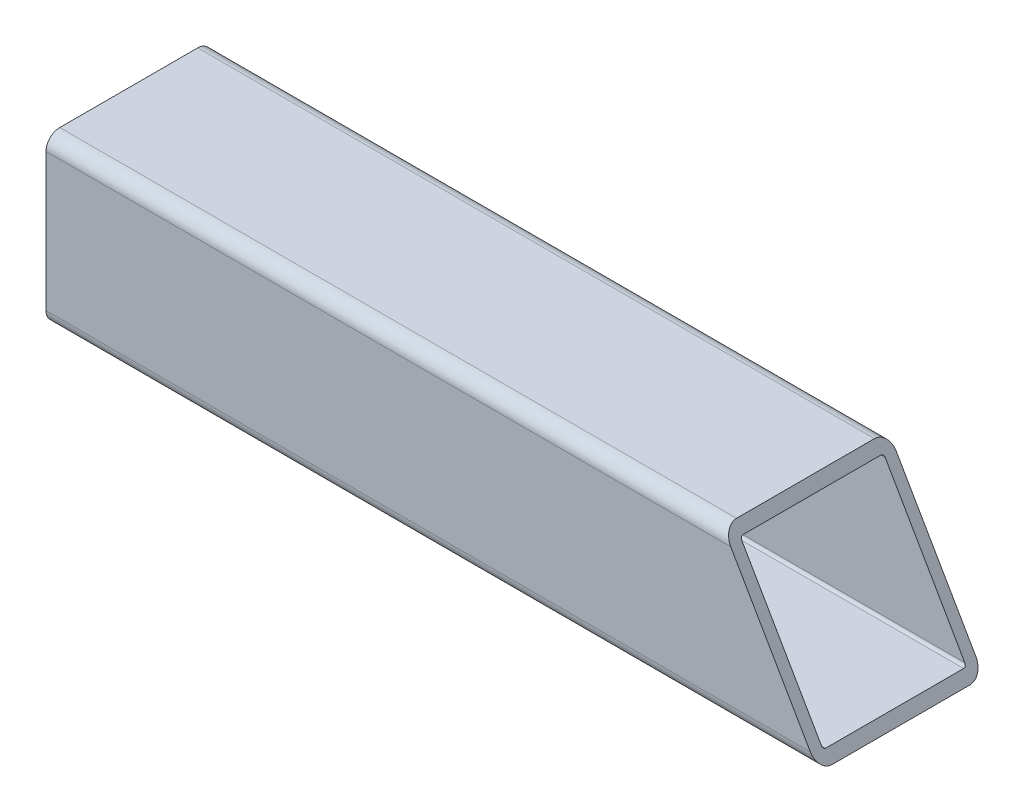
ISO-10303-21;
HEADER;
FILE_DESCRIPTION(('STEP AP214'),'2;1');
FILE_NAME('part.step','',(''),(''),'','','');
FILE_SCHEMA(('AUTOMOTIVE_DESIGN { 1 0 10303 214 1 1 1 1 }'));
ENDSEC;
DATA;
#1=APPLICATION_CONTEXT('core data for automotive mechanical design processes');
#2=APPLICATION_PROTOCOL_DEFINITION('international standard','automotive_design',2000,#1);
#3=PRODUCT_CONTEXT('',#1,'mechanical');
#4=PRODUCT('Part','Part','',(#3));
#5=PRODUCT_RELATED_PRODUCT_CATEGORY('part','',(#4));
#6=PRODUCT_DEFINITION_FORMATION('','',#4);
#7=PRODUCT_DEFINITION_CONTEXT('part definition',#1,'design');
#8=PRODUCT_DEFINITION('design','',#6,#7);
#9=PRODUCT_DEFINITION_SHAPE('','',#8);
#10=(LENGTH_UNIT() NAMED_UNIT(*) SI_UNIT(.MILLI.,.METRE.));
#11=(NAMED_UNIT(*) PLANE_ANGLE_UNIT() SI_UNIT($,.RADIAN.));
#12=(NAMED_UNIT(*) SI_UNIT($,.STERADIAN.) SOLID_ANGLE_UNIT());
#13=UNCERTAINTY_MEASURE_WITH_UNIT(LENGTH_MEASURE(1.E-05),#10,'distance_accuracy_value','');
#14=(GEOMETRIC_REPRESENTATION_CONTEXT(3) GLOBAL_UNCERTAINTY_ASSIGNED_CONTEXT((#13)) GLOBAL_UNIT_ASSIGNED_CONTEXT((#10,
#11,#12)) REPRESENTATION_CONTEXT('',''));
#15=CARTESIAN_POINT('',(0.,0.,0.));
#16=DIRECTION('',(0.,0.,1.));
#17=DIRECTION('',(1.,0.,0.));
#18=AXIS2_PLACEMENT_3D('',#15,#16,#17);
#19=CARTESIAN_POINT('',(-88.9,-15.875,15.875));
#20=DIRECTION('',(1.,0.,0.));
#21=DIRECTION('',(0.,0.,-1.));
#22=AXIS2_PLACEMENT_3D('',#19,#20,#21);
#23=PLANE('',#22);
#24=CARTESIAN_POINT('',(-88.9,-15.875,15.875));
#25=DIRECTION('',(1.,0.,0.));
#26=DIRECTION('',(0.,0.,-1.));
#27=AXIS2_PLACEMENT_3D('',#24,#25,#26);
#28=CIRCLE('',#27,3.175);
#29=CARTESIAN_POINT('',(-88.9,-15.875,19.05));
#30=VERTEX_POINT('',#29);
#31=CARTESIAN_POINT('',(-88.9,-19.05,15.875));
#32=VERTEX_POINT('',#31);
#33=EDGE_CURVE('E243',#30,#32,#28,.T.);
#34=ORIENTED_EDGE('',*,*,#33,.F.);
#35=DIRECTION('',(0.,-1.,0.));
#36=VECTOR('',#35,1.);
#37=CARTESIAN_POINT('',(-88.9,15.875,19.05));
#38=LINE('',#37,#36);
#39=CARTESIAN_POINT('',(-88.9,15.875,19.05));
#40=VERTEX_POINT('',#39);
#41=EDGE_CURVE('E267',#40,#30,#38,.T.);
#42=ORIENTED_EDGE('',*,*,#41,.F.);
#43=CARTESIAN_POINT('',(-88.9,15.875,15.875));
#44=DIRECTION('',(1.,0.,0.));
#45=DIRECTION('',(0.,0.,-1.));
#46=AXIS2_PLACEMENT_3D('',#43,#44,#45);
#47=CIRCLE('',#46,3.175);
#48=CARTESIAN_POINT('',(-88.9,19.05,15.875));
#49=VERTEX_POINT('',#48);
#50=EDGE_CURVE('E265',#49,#40,#47,.T.);
#51=ORIENTED_EDGE('',*,*,#50,.F.);
#52=DIRECTION('',(0.,0.,1.));
#53=VECTOR('',#52,1.);
#54=CARTESIAN_POINT('',(-88.9,19.05,15.875));
#55=LINE('',#54,#53);
#56=CARTESIAN_POINT('',(-88.9,19.05,-15.875));
#57=VERTEX_POINT('',#56);
#58=EDGE_CURVE('E216',#57,#49,#55,.T.);
#59=ORIENTED_EDGE('',*,*,#58,.F.);
#60=CARTESIAN_POINT('',(-88.9,15.875,-15.875));
#61=DIRECTION('',(1.,0.,0.));
#62=DIRECTION('',(0.,0.,-1.));
#63=AXIS2_PLACEMENT_3D('',#60,#61,#62);
#64=CIRCLE('',#63,3.175);
#65=CARTESIAN_POINT('',(-88.9,15.875,-19.05));
#66=VERTEX_POINT('',#65);
#67=EDGE_CURVE('E261',#66,#57,#64,.T.);
#68=ORIENTED_EDGE('',*,*,#67,.F.);
#69=DIRECTION('',(0.,1.,0.));
#70=VECTOR('',#69,1.);
#71=CARTESIAN_POINT('',(-88.9,15.875,-19.05));
#72=LINE('',#71,#70);
#73=CARTESIAN_POINT('',(-88.9,-15.875,-19.05));
#74=VERTEX_POINT('',#73);
#75=EDGE_CURVE('E258',#74,#66,#72,.T.);
#76=ORIENTED_EDGE('',*,*,#75,.F.);
#77=CARTESIAN_POINT('',(-88.9,-15.875,-15.875));
#78=DIRECTION('',(1.,0.,0.));
#79=DIRECTION('',(0.,0.,-1.));
#80=AXIS2_PLACEMENT_3D('',#77,#78,#79);
#81=CIRCLE('',#80,3.175);
#82=CARTESIAN_POINT('',(-88.9,-19.05,-15.875));
#83=VERTEX_POINT('',#82);
#84=EDGE_CURVE('E250',#83,#74,#81,.T.);
#85=ORIENTED_EDGE('',*,*,#84,.F.);
#86=DIRECTION('',(0.,0.,-1.));
#87=VECTOR('',#86,1.);
#88=CARTESIAN_POINT('',(-88.9,-19.05,15.875));
#89=LINE('',#88,#87);
#90=EDGE_CURVE('E238',#32,#83,#89,.T.);
#91=ORIENTED_EDGE('',*,*,#90,.F.);
#92=EDGE_LOOP('',(#34,#42,#51,#59,#68,#76,#85,#91));
#93=FACE_BOUND('',#92,.T.);
#94=CARTESIAN_POINT('',(-88.9,-15.875,15.875));
#95=DIRECTION('',(1.,0.,0.));
#96=DIRECTION('',(0.,0.,-1.));
#97=AXIS2_PLACEMENT_3D('',#94,#95,#96);
#98=CIRCLE('',#97,0.635000000000002);
#99=CARTESIAN_POINT('',(-88.9,-15.875,16.51));
#100=VERTEX_POINT('',#99);
#101=CARTESIAN_POINT('',(-88.9,-16.51,15.875));
#102=VERTEX_POINT('',#101);
#103=EDGE_CURVE('E275',#100,#102,#98,.T.);
#104=ORIENTED_EDGE('',*,*,#103,.T.);
#105=DIRECTION('',(0.,0.,-1.));
#106=VECTOR('',#105,1.);
#107=CARTESIAN_POINT('',(-88.9,-16.51,15.875));
#108=LINE('',#107,#106);
#109=CARTESIAN_POINT('',(-88.9,-16.51,-15.875));
#110=VERTEX_POINT('',#109);
#111=EDGE_CURVE('E279',#102,#110,#108,.T.);
#112=ORIENTED_EDGE('',*,*,#111,.T.);
#113=CARTESIAN_POINT('',(-88.9,-15.875,-15.875));
#114=DIRECTION('',(1.,0.,0.));
#115=DIRECTION('',(0.,0.,-1.));
#116=AXIS2_PLACEMENT_3D('',#113,#114,#115);
#117=CIRCLE('',#116,0.634999999999999);
#118=CARTESIAN_POINT('',(-88.9,-15.875,-16.51));
#119=VERTEX_POINT('',#118);
#120=EDGE_CURVE('E286',#110,#119,#117,.T.);
#121=ORIENTED_EDGE('',*,*,#120,.T.);
#122=DIRECTION('',(0.,1.,0.));
#123=VECTOR('',#122,1.);
#124=CARTESIAN_POINT('',(-88.9,15.875,-16.51));
#125=LINE('',#124,#123);
#126=CARTESIAN_POINT('',(-88.9,15.875,-16.51));
#127=VERTEX_POINT('',#126);
#128=EDGE_CURVE('E289',#119,#127,#125,.T.);
#129=ORIENTED_EDGE('',*,*,#128,.T.);
#130=CARTESIAN_POINT('',(-88.9,15.875,-15.875));
#131=DIRECTION('',(1.,0.,0.));
#132=DIRECTION('',(0.,0.,-1.));
#133=AXIS2_PLACEMENT_3D('',#130,#131,#132);
#134=CIRCLE('',#133,0.635000000000004);
#135=CARTESIAN_POINT('',(-88.9,16.51,-15.875));
#136=VERTEX_POINT('',#135);
#137=EDGE_CURVE('E292',#127,#136,#134,.T.);
#138=ORIENTED_EDGE('',*,*,#137,.T.);
#139=DIRECTION('',(0.,0.,1.));
#140=VECTOR('',#139,1.);
#141=CARTESIAN_POINT('',(-88.9,16.51,15.875));
#142=LINE('',#141,#140);
#143=CARTESIAN_POINT('',(-88.9,16.51,15.875));
#144=VERTEX_POINT('',#143);
#145=EDGE_CURVE('E295',#136,#144,#142,.T.);
#146=ORIENTED_EDGE('',*,*,#145,.T.);
#147=CARTESIAN_POINT('',(-88.9,15.875,15.875));
#148=DIRECTION('',(1.,0.,0.));
#149=DIRECTION('',(0.,0.,-1.));
#150=AXIS2_PLACEMENT_3D('',#147,#148,#149);
#151=CIRCLE('',#150,0.635000000000004);
#152=CARTESIAN_POINT('',(-88.9,15.875,16.51));
#153=VERTEX_POINT('',#152);
#154=EDGE_CURVE('E298',#144,#153,#151,.T.);
#155=ORIENTED_EDGE('',*,*,#154,.T.);
#156=DIRECTION('',(0.,-1.,0.));
#157=VECTOR('',#156,1.);
#158=CARTESIAN_POINT('',(-88.9,15.875,16.51));
#159=LINE('',#158,#157);
#160=EDGE_CURVE('E301',#153,#100,#159,.T.);
#161=ORIENTED_EDGE('',*,*,#160,.T.);
#162=EDGE_LOOP('',(#104,#112,#121,#129,#138,#146,#155,#161));
#163=FACE_BOUND('',#162,.T.);
#164=ADVANCED_FACE('F83',(#93,#163),#23,.F.);
#165=CARTESIAN_POINT('',(88.9,-15.875,15.875));
#166=DIRECTION('',(-1.,0.,0.));
#167=DIRECTION('',(0.,0.,1.));
#168=AXIS2_PLACEMENT_3D('',#165,#166,#167);
#169=CYLINDRICAL_SURFACE('',#168,3.175);
#170=DIRECTION('',(-1.,0.,0.));
#171=VECTOR('',#170,1.);
#172=CARTESIAN_POINT('',(88.9,-19.05,15.875));
#173=LINE('',#172,#171);
#174=CARTESIAN_POINT('',(88.9,-19.05,15.875));
#175=VERTEX_POINT('',#174);
#176=EDGE_CURVE('E91',#175,#32,#173,.T.);
#177=ORIENTED_EDGE('',*,*,#176,.F.);
#178=CARTESIAN_POINT('',(87.066912895323,-15.875,15.875));
#179=DIRECTION('',(-0.866025403784441,-0.499999999999995,0.));
#180=DIRECTION('',(-0.499999999999995,0.866025403784441,0.));
#181=AXIS2_PLACEMENT_3D('',#178,#179,#180);
#182=ELLIPSE('',#181,3.66617420935411,3.175);
#183=CARTESIAN_POINT('',(87.066912895323,-15.875,19.05));
#184=VERTEX_POINT('',#183);
#185=EDGE_CURVE('E211',#175,#184,#182,.T.);
#186=ORIENTED_EDGE('',*,*,#185,.T.);
#187=DIRECTION('',(-1.,0.,0.));
#188=VECTOR('',#187,1.);
#189=CARTESIAN_POINT('',(88.9,-15.875,19.05));
#190=LINE('',#189,#188);
#191=EDGE_CURVE('E222',#184,#30,#190,.T.);
#192=ORIENTED_EDGE('',*,*,#191,.T.);
#193=ORIENTED_EDGE('',*,*,#33,.T.);
#194=EDGE_LOOP('',(#177,#186,#192,#193));
#195=FACE_BOUND('',#194,.T.);
#196=ADVANCED_FACE('F85',(#195),#169,.T.);
#197=CARTESIAN_POINT('',(88.9,-19.05,15.875));
#198=DIRECTION('',(0.,1.,0.));
#199=DIRECTION('',(0.,0.,1.));
#200=AXIS2_PLACEMENT_3D('',#197,#198,#199);
#201=PLANE('',#200);
#202=ORIENTED_EDGE('',*,*,#90,.T.);
#203=DIRECTION('',(-1.,0.,0.));
#204=VECTOR('',#203,1.);
#205=CARTESIAN_POINT('',(88.9,-19.05,-15.875));
#206=LINE('',#205,#204);
#207=CARTESIAN_POINT('',(88.9,-19.05,-15.875));
#208=VERTEX_POINT('',#207);
#209=EDGE_CURVE('E229',#208,#83,#206,.T.);
#210=ORIENTED_EDGE('',*,*,#209,.F.);
#211=DIRECTION('',(0.,0.,-1.));
#212=VECTOR('',#211,1.);
#213=CARTESIAN_POINT('',(88.9,-19.05,15.875));
#214=LINE('',#213,#212);
#215=EDGE_CURVE('E239',#175,#208,#214,.T.);
#216=ORIENTED_EDGE('',*,*,#215,.F.);
#217=ORIENTED_EDGE('',*,*,#176,.T.);
#218=EDGE_LOOP('',(#202,#210,#216,#217));
#219=FACE_BOUND('',#218,.T.);
#220=ADVANCED_FACE('F236',(#219),#201,.F.);
#221=CARTESIAN_POINT('',(88.9,-15.875,-15.875));
#222=DIRECTION('',(-1.,0.,0.));
#223=DIRECTION('',(0.,0.,1.));
#224=AXIS2_PLACEMENT_3D('',#221,#222,#223);
#225=CYLINDRICAL_SURFACE('',#224,3.175);
#226=DIRECTION('',(-1.,0.,0.));
#227=VECTOR('',#226,1.);
#228=CARTESIAN_POINT('',(88.9,-15.875,-19.05));
#229=LINE('',#228,#227);
#230=CARTESIAN_POINT('',(87.066912895323,-15.875,-19.05));
#231=VERTEX_POINT('',#230);
#232=EDGE_CURVE('E227',#231,#74,#229,.T.);
#233=ORIENTED_EDGE('',*,*,#232,.F.);
#234=CARTESIAN_POINT('',(87.066912895323,-15.875,-15.875));
#235=DIRECTION('',(-0.866025403784441,-0.499999999999995,0.));
#236=DIRECTION('',(-0.499999999999995,0.866025403784441,0.));
#237=AXIS2_PLACEMENT_3D('',#234,#235,#236);
#238=ELLIPSE('',#237,3.66617420935411,3.175);
#239=EDGE_CURVE('E269',#231,#208,#238,.T.);
#240=ORIENTED_EDGE('',*,*,#239,.T.);
#241=ORIENTED_EDGE('',*,*,#209,.T.);
#242=ORIENTED_EDGE('',*,*,#84,.T.);
#243=EDGE_LOOP('',(#233,#240,#241,#242));
#244=FACE_BOUND('',#243,.T.);
#245=ADVANCED_FACE('F273',(#244),#225,.T.);
#246=CARTESIAN_POINT('',(88.9,15.875,-19.05));
#247=DIRECTION('',(0.,0.,1.));
#248=DIRECTION('',(0.,-1.,0.));
#249=AXIS2_PLACEMENT_3D('',#246,#247,#248);
#250=PLANE('',#249);
#251=DIRECTION('',(-1.,0.,0.));
#252=VECTOR('',#251,1.);
#253=CARTESIAN_POINT('',(88.9,15.875,-19.05));
#254=LINE('',#253,#252);
#255=CARTESIAN_POINT('',(68.7360418485526,15.875,-19.05));
#256=VERTEX_POINT('',#255);
#257=EDGE_CURVE('E220',#256,#66,#254,.T.);
#258=ORIENTED_EDGE('',*,*,#257,.F.);
#259=DIRECTION('',(0.499999999999995,-0.866025403784441,0.));
#260=VECTOR('',#259,1.);
#261=CARTESIAN_POINT('',(73.7770313864143,7.14375000000017,-19.05));
#262=LINE('',#261,#260);
#263=EDGE_CURVE('E276',#256,#231,#262,.T.);
#264=ORIENTED_EDGE('',*,*,#263,.T.);
#265=ORIENTED_EDGE('',*,*,#232,.T.);
#266=ORIENTED_EDGE('',*,*,#75,.T.);
#267=EDGE_LOOP('',(#258,#264,#265,#266));
#268=FACE_BOUND('',#267,.T.);
#269=ADVANCED_FACE('F346',(#268),#250,.F.);
#270=CARTESIAN_POINT('',(88.9,15.875,-15.875));
#271=DIRECTION('',(-1.,0.,0.));
#272=DIRECTION('',(0.,0.,1.));
#273=AXIS2_PLACEMENT_3D('',#270,#271,#272);
#274=CYLINDRICAL_SURFACE('',#273,3.175);
#275=DIRECTION('',(-1.,0.,0.));
#276=VECTOR('',#275,1.);
#277=CARTESIAN_POINT('',(88.9,19.05,-15.875));
#278=LINE('',#277,#276);
#279=CARTESIAN_POINT('',(66.9029547438755,19.05,-15.875));
#280=VERTEX_POINT('',#279);
#281=EDGE_CURVE('E218',#280,#57,#278,.T.);
#282=ORIENTED_EDGE('',*,*,#281,.F.);
#283=CARTESIAN_POINT('',(68.7360418485526,15.875,-15.875));
#284=DIRECTION('',(-0.866025403784441,-0.499999999999995,0.));
#285=DIRECTION('',(-0.499999999999995,0.866025403784441,0.));
#286=AXIS2_PLACEMENT_3D('',#283,#284,#285);
#287=ELLIPSE('',#286,3.66617420935412,3.175);
#288=EDGE_CURVE('E198',#280,#256,#287,.T.);
#289=ORIENTED_EDGE('',*,*,#288,.T.);
#290=ORIENTED_EDGE('',*,*,#257,.T.);
#291=ORIENTED_EDGE('',*,*,#67,.T.);
#292=EDGE_LOOP('',(#282,#289,#290,#291));
#293=FACE_BOUND('',#292,.T.);
#294=ADVANCED_FACE('F344',(#293),#274,.T.);
#295=CARTESIAN_POINT('',(88.9,19.05,15.875));
#296=DIRECTION('',(0.,-1.,0.));
#297=DIRECTION('',(0.,0.,-1.));
#298=AXIS2_PLACEMENT_3D('',#295,#296,#297);
#299=PLANE('',#298);
#300=DIRECTION('',(-1.,0.,0.));
#301=VECTOR('',#300,1.);
#302=CARTESIAN_POINT('',(88.9,19.05,15.875));
#303=LINE('',#302,#301);
#304=CARTESIAN_POINT('',(66.9029547438755,19.05,15.875));
#305=VERTEX_POINT('',#304);
#306=EDGE_CURVE('E208',#305,#49,#303,.T.);
#307=ORIENTED_EDGE('',*,*,#306,.F.);
#308=DIRECTION('',(0.,0.,-1.));
#309=VECTOR('',#308,1.);
#310=CARTESIAN_POINT('',(66.9029547438755,19.05,255.249979058454));
#311=LINE('',#310,#309);
#312=EDGE_CURVE('E195',#305,#280,#311,.T.);
#313=ORIENTED_EDGE('',*,*,#312,.T.);
#314=ORIENTED_EDGE('',*,*,#281,.T.);
#315=ORIENTED_EDGE('',*,*,#58,.T.);
#316=EDGE_LOOP('',(#307,#313,#314,#315));
#317=FACE_BOUND('',#316,.T.);
#318=ADVANCED_FACE('F214',(#317),#299,.F.);
#319=CARTESIAN_POINT('',(88.9,15.875,15.875));
#320=DIRECTION('',(-1.,0.,0.));
#321=DIRECTION('',(0.,0.,1.));
#322=AXIS2_PLACEMENT_3D('',#319,#320,#321);
#323=CYLINDRICAL_SURFACE('',#322,3.175);
#324=DIRECTION('',(-1.,0.,0.));
#325=VECTOR('',#324,1.);
#326=CARTESIAN_POINT('',(88.9,15.875,19.05));
#327=LINE('',#326,#325);
#328=CARTESIAN_POINT('',(68.7360418485526,15.875,19.05));
#329=VERTEX_POINT('',#328);
#330=EDGE_CURVE('E210',#329,#40,#327,.T.);
#331=ORIENTED_EDGE('',*,*,#330,.F.);
#332=CARTESIAN_POINT('',(68.7360418485526,15.875,15.875));
#333=DIRECTION('',(-0.866025403784441,-0.499999999999995,0.));
#334=DIRECTION('',(-0.499999999999995,0.866025403784441,0.));
#335=AXIS2_PLACEMENT_3D('',#332,#333,#334);
#336=ELLIPSE('',#335,3.66617420935412,3.175);
#337=EDGE_CURVE('E98',#329,#305,#336,.T.);
#338=ORIENTED_EDGE('',*,*,#337,.T.);
#339=ORIENTED_EDGE('',*,*,#306,.T.);
#340=ORIENTED_EDGE('',*,*,#50,.T.);
#341=EDGE_LOOP('',(#331,#338,#339,#340));
#342=FACE_BOUND('',#341,.T.);
#343=ADVANCED_FACE('F206',(#342),#323,.T.);
#344=CARTESIAN_POINT('',(88.9,15.875,19.05));
#345=DIRECTION('',(0.,0.,-1.));
#346=DIRECTION('',(0.,1.,0.));
#347=AXIS2_PLACEMENT_3D('',#344,#345,#346);
#348=PLANE('',#347);
#349=ORIENTED_EDGE('',*,*,#191,.F.);
#350=DIRECTION('',(-0.499999999999995,0.866025403784441,0.));
#351=VECTOR('',#350,1.);
#352=CARTESIAN_POINT('',(73.7770313864143,7.14375000000017,19.05));
#353=LINE('',#352,#351);
#354=EDGE_CURVE('E212',#184,#329,#353,.T.);
#355=ORIENTED_EDGE('',*,*,#354,.T.);
#356=ORIENTED_EDGE('',*,*,#330,.T.);
#357=ORIENTED_EDGE('',*,*,#41,.T.);
#358=EDGE_LOOP('',(#349,#355,#356,#357));
#359=FACE_BOUND('',#358,.T.);
#360=ADVANCED_FACE('F350',(#359),#348,.F.);
#361=CARTESIAN_POINT('',(88.9,-15.875,15.875));
#362=DIRECTION('',(-1.,0.,0.));
#363=DIRECTION('',(0.,0.,1.));
#364=AXIS2_PLACEMENT_3D('',#361,#362,#363);
#365=CYLINDRICAL_SURFACE('',#364,0.635000000000002);
#366=CARTESIAN_POINT('',(87.066912895323,-15.875,15.875));
#367=DIRECTION('',(-0.866025403784441,-0.499999999999995,0.));
#368=DIRECTION('',(-0.499999999999995,0.866025403784441,0.));
#369=AXIS2_PLACEMENT_3D('',#366,#367,#368);
#370=ELLIPSE('',#369,0.733234841870825,0.635000000000002);
#371=CARTESIAN_POINT('',(87.4335303162584,-16.51,15.875));
#372=VERTEX_POINT('',#371);
#373=CARTESIAN_POINT('',(87.066912895323,-15.875,16.51));
#374=VERTEX_POINT('',#373);
#375=EDGE_CURVE('E106',#372,#374,#370,.T.);
#376=ORIENTED_EDGE('',*,*,#375,.F.);
#377=DIRECTION('',(-1.,0.,0.));
#378=VECTOR('',#377,1.);
#379=CARTESIAN_POINT('',(88.9,-16.51,15.875));
#380=LINE('',#379,#378);
#381=EDGE_CURVE('E248',#372,#102,#380,.T.);
#382=ORIENTED_EDGE('',*,*,#381,.T.);
#383=ORIENTED_EDGE('',*,*,#103,.F.);
#384=DIRECTION('',(-1.,0.,0.));
#385=VECTOR('',#384,1.);
#386=CARTESIAN_POINT('',(88.9,-15.875,16.51));
#387=LINE('',#386,#385);
#388=EDGE_CURVE('E304',#374,#100,#387,.T.);
#389=ORIENTED_EDGE('',*,*,#388,.F.);
#390=EDGE_LOOP('',(#376,#382,#383,#389));
#391=FACE_BOUND('',#390,.T.);
#392=ADVANCED_FACE('F331',(#391),#365,.F.);
#393=CARTESIAN_POINT('',(88.9,-16.51,15.875));
#394=DIRECTION('',(0.,1.,0.));
#395=DIRECTION('',(0.,0.,1.));
#396=AXIS2_PLACEMENT_3D('',#393,#394,#395);
#397=PLANE('',#396);
#398=DIRECTION('',(0.,0.,1.));
#399=VECTOR('',#398,1.);
#400=CARTESIAN_POINT('',(87.4335303162584,-16.51,15.875));
#401=LINE('',#400,#399);
#402=CARTESIAN_POINT('',(87.4335303162584,-16.51,-15.875));
#403=VERTEX_POINT('',#402);
#404=EDGE_CURVE('E322',#403,#372,#401,.T.);
#405=ORIENTED_EDGE('',*,*,#404,.F.);
#406=DIRECTION('',(-1.,0.,0.));
#407=VECTOR('',#406,1.);
#408=CARTESIAN_POINT('',(88.9,-16.51,-15.875));
#409=LINE('',#408,#407);
#410=EDGE_CURVE('E252',#403,#110,#409,.T.);
#411=ORIENTED_EDGE('',*,*,#410,.T.);
#412=ORIENTED_EDGE('',*,*,#111,.F.);
#413=ORIENTED_EDGE('',*,*,#381,.F.);
#414=EDGE_LOOP('',(#405,#411,#412,#413));
#415=FACE_BOUND('',#414,.T.);
#416=ADVANCED_FACE('F320',(#415),#397,.T.);
#417=CARTESIAN_POINT('',(88.9,-15.875,-15.875));
#418=DIRECTION('',(-1.,0.,0.));
#419=DIRECTION('',(0.,0.,1.));
#420=AXIS2_PLACEMENT_3D('',#417,#418,#419);
#421=CYLINDRICAL_SURFACE('',#420,0.634999999999999);
#422=CARTESIAN_POINT('',(87.066912895323,-15.875,-15.875));
#423=DIRECTION('',(-0.866025403784441,-0.499999999999995,0.));
#424=DIRECTION('',(-0.499999999999995,0.866025403784441,0.));
#425=AXIS2_PLACEMENT_3D('',#422,#423,#424);
#426=ELLIPSE('',#425,0.733234841870821,0.634999999999999);
#427=CARTESIAN_POINT('',(87.066912895323,-15.875,-16.51));
#428=VERTEX_POINT('',#427);
#429=EDGE_CURVE('E334',#428,#403,#426,.T.);
#430=ORIENTED_EDGE('',*,*,#429,.F.);
#431=DIRECTION('',(-1.,0.,0.));
#432=VECTOR('',#431,1.);
#433=CARTESIAN_POINT('',(88.9,-15.875,-16.51));
#434=LINE('',#433,#432);
#435=EDGE_CURVE('E314',#428,#119,#434,.T.);
#436=ORIENTED_EDGE('',*,*,#435,.T.);
#437=ORIENTED_EDGE('',*,*,#120,.F.);
#438=ORIENTED_EDGE('',*,*,#410,.F.);
#439=EDGE_LOOP('',(#430,#436,#437,#438));
#440=FACE_BOUND('',#439,.T.);
#441=ADVANCED_FACE('F325',(#440),#421,.F.);
#442=CARTESIAN_POINT('',(88.9,15.875,-16.51));
#443=DIRECTION('',(0.,0.,1.));
#444=DIRECTION('',(0.,-1.,0.));
#445=AXIS2_PLACEMENT_3D('',#442,#443,#444);
#446=PLANE('',#445);
#447=DIRECTION('',(0.499999999999995,-0.866025403784441,0.));
#448=VECTOR('',#447,1.);
#449=CARTESIAN_POINT('',(73.7770313864143,7.14375000000017,-16.51));
#450=LINE('',#449,#448);
#451=CARTESIAN_POINT('',(68.7360418485526,15.875,-16.51));
#452=VERTEX_POINT('',#451);
#453=EDGE_CURVE('E337',#452,#428,#450,.T.);
#454=ORIENTED_EDGE('',*,*,#453,.F.);
#455=DIRECTION('',(-1.,0.,0.));
#456=VECTOR('',#455,1.);
#457=CARTESIAN_POINT('',(88.9,15.875,-16.51));
#458=LINE('',#457,#456);
#459=EDGE_CURVE('E312',#452,#127,#458,.T.);
#460=ORIENTED_EDGE('',*,*,#459,.T.);
#461=ORIENTED_EDGE('',*,*,#128,.F.);
#462=ORIENTED_EDGE('',*,*,#435,.F.);
#463=EDGE_LOOP('',(#454,#460,#461,#462));
#464=FACE_BOUND('',#463,.T.);
#465=ADVANCED_FACE('F369',(#464),#446,.T.);
#466=CARTESIAN_POINT('',(88.9,15.875,-15.875));
#467=DIRECTION('',(-1.,0.,0.));
#468=DIRECTION('',(0.,0.,1.));
#469=AXIS2_PLACEMENT_3D('',#466,#467,#468);
#470=CYLINDRICAL_SURFACE('',#469,0.635000000000004);
#471=CARTESIAN_POINT('',(68.7360418485526,15.875,-15.875));
#472=DIRECTION('',(-0.866025403784441,-0.499999999999995,0.));
#473=DIRECTION('',(-0.499999999999995,0.866025403784441,0.));
#474=AXIS2_PLACEMENT_3D('',#471,#472,#473);
#475=ELLIPSE('',#474,0.733234841870827,0.635000000000004);
#476=CARTESIAN_POINT('',(68.3694244276172,16.51,-15.875));
#477=VERTEX_POINT('',#476);
#478=EDGE_CURVE('E527',#477,#452,#475,.T.);
#479=ORIENTED_EDGE('',*,*,#478,.F.);
#480=DIRECTION('',(-1.,0.,0.));
#481=VECTOR('',#480,1.);
#482=CARTESIAN_POINT('',(88.9,16.51,-15.875));
#483=LINE('',#482,#481);
#484=EDGE_CURVE('E310',#477,#136,#483,.T.);
#485=ORIENTED_EDGE('',*,*,#484,.T.);
#486=ORIENTED_EDGE('',*,*,#137,.F.);
#487=ORIENTED_EDGE('',*,*,#459,.F.);
#488=EDGE_LOOP('',(#479,#485,#486,#487));
#489=FACE_BOUND('',#488,.T.);
#490=ADVANCED_FACE('F372',(#489),#470,.F.);
#491=CARTESIAN_POINT('',(88.9,16.51,15.875));
#492=DIRECTION('',(0.,-1.,0.));
#493=DIRECTION('',(0.,0.,-1.));
#494=AXIS2_PLACEMENT_3D('',#491,#492,#493);
#495=PLANE('',#494);
#496=DIRECTION('',(0.,0.,-1.));
#497=VECTOR('',#496,1.);
#498=CARTESIAN_POINT('',(68.3694244276172,16.51,15.875));
#499=LINE('',#498,#497);
#500=CARTESIAN_POINT('',(68.3694244276172,16.51,15.875));
#501=VERTEX_POINT('',#500);
#502=EDGE_CURVE('E524',#501,#477,#499,.T.);
#503=ORIENTED_EDGE('',*,*,#502,.F.);
#504=DIRECTION('',(-1.,0.,0.));
#505=VECTOR('',#504,1.);
#506=CARTESIAN_POINT('',(88.9,16.51,15.875));
#507=LINE('',#506,#505);
#508=EDGE_CURVE('E308',#501,#144,#507,.T.);
#509=ORIENTED_EDGE('',*,*,#508,.T.);
#510=ORIENTED_EDGE('',*,*,#145,.F.);
#511=ORIENTED_EDGE('',*,*,#484,.F.);
#512=EDGE_LOOP('',(#503,#509,#510,#511));
#513=FACE_BOUND('',#512,.T.);
#514=ADVANCED_FACE('F376',(#513),#495,.T.);
#515=CARTESIAN_POINT('',(88.9,15.875,15.875));
#516=DIRECTION('',(-1.,0.,0.));
#517=DIRECTION('',(0.,0.,1.));
#518=AXIS2_PLACEMENT_3D('',#515,#516,#517);
#519=CYLINDRICAL_SURFACE('',#518,0.635000000000004);
#520=CARTESIAN_POINT('',(68.7360418485526,15.875,15.875));
#521=DIRECTION('',(-0.866025403784441,-0.499999999999995,0.));
#522=DIRECTION('',(-0.499999999999995,0.866025403784441,0.));
#523=AXIS2_PLACEMENT_3D('',#520,#521,#522);
#524=ELLIPSE('',#523,0.733234841870827,0.635000000000004);
#525=CARTESIAN_POINT('',(68.7360418485526,15.875,16.51));
#526=VERTEX_POINT('',#525);
#527=EDGE_CURVE('E202',#526,#501,#524,.T.);
#528=ORIENTED_EDGE('',*,*,#527,.F.);
#529=DIRECTION('',(-1.,0.,0.));
#530=VECTOR('',#529,1.);
#531=CARTESIAN_POINT('',(88.9,15.875,16.51));
#532=LINE('',#531,#530);
#533=EDGE_CURVE('E306',#526,#153,#532,.T.);
#534=ORIENTED_EDGE('',*,*,#533,.T.);
#535=ORIENTED_EDGE('',*,*,#154,.F.);
#536=ORIENTED_EDGE('',*,*,#508,.F.);
#537=EDGE_LOOP('',(#528,#534,#535,#536));
#538=FACE_BOUND('',#537,.T.);
#539=ADVANCED_FACE('F380',(#538),#519,.F.);
#540=CARTESIAN_POINT('',(88.9,15.875,16.51));
#541=DIRECTION('',(0.,0.,-1.));
#542=DIRECTION('',(0.,1.,0.));
#543=AXIS2_PLACEMENT_3D('',#540,#541,#542);
#544=PLANE('',#543);
#545=DIRECTION('',(-0.499999999999995,0.866025403784441,0.));
#546=VECTOR('',#545,1.);
#547=CARTESIAN_POINT('',(73.7770313864143,7.14375000000017,16.51));
#548=LINE('',#547,#546);
#549=EDGE_CURVE('E12',#374,#526,#548,.T.);
#550=ORIENTED_EDGE('',*,*,#549,.F.);
#551=ORIENTED_EDGE('',*,*,#388,.T.);
#552=ORIENTED_EDGE('',*,*,#160,.F.);
#553=ORIENTED_EDGE('',*,*,#533,.F.);
#554=EDGE_LOOP('',(#550,#551,#552,#553));
#555=FACE_BOUND('',#554,.T.);
#556=ADVANCED_FACE('F384',(#555),#544,.T.);
#557=CARTESIAN_POINT('',(88.9,-19.05,255.249979058454));
#558=DIRECTION('',(-0.866025403784441,-0.499999999999995,0.));
#559=DIRECTION('',(0.499999999999995,-0.866025403784441,0.));
#560=AXIS2_PLACEMENT_3D('',#557,#558,#559);
#561=PLANE('',#560);
#562=ORIENTED_EDGE('',*,*,#404,.T.);
#563=ORIENTED_EDGE('',*,*,#375,.T.);
#564=ORIENTED_EDGE('',*,*,#549,.T.);
#565=ORIENTED_EDGE('',*,*,#527,.T.);
#566=ORIENTED_EDGE('',*,*,#502,.T.);
#567=ORIENTED_EDGE('',*,*,#478,.T.);
#568=ORIENTED_EDGE('',*,*,#453,.T.);
#569=ORIENTED_EDGE('',*,*,#429,.T.);
#570=EDGE_LOOP('',(#562,#563,#564,#565,#566,#567,#568,#569));
#571=FACE_BOUND('',#570,.T.);
#572=ORIENTED_EDGE('',*,*,#239,.F.);
#573=ORIENTED_EDGE('',*,*,#263,.F.);
#574=ORIENTED_EDGE('',*,*,#288,.F.);
#575=ORIENTED_EDGE('',*,*,#312,.F.);
#576=ORIENTED_EDGE('',*,*,#337,.F.);
#577=ORIENTED_EDGE('',*,*,#354,.F.);
#578=ORIENTED_EDGE('',*,*,#185,.F.);
#579=ORIENTED_EDGE('',*,*,#215,.T.);
#580=EDGE_LOOP('',(#572,#573,#574,#575,#576,#577,#578,#579));
#581=FACE_BOUND('',#580,.T.);
#582=ADVANCED_FACE('F196',(#571,#581),#561,.F.);
#583=CLOSED_SHELL('',(#164,#196,#220,#245,#269,#294,#318,#343,#360,#392,#416,#441,#465,#490,
#514,#539,#556,#582));
#584=MANIFOLD_SOLID_BREP('B2',#583);
#585=ADVANCED_BREP_SHAPE_REPRESENTATION('',(#18,#584),#14);
#586=SHAPE_DEFINITION_REPRESENTATION(#9,#585);
ENDSEC;
END-ISO-10303-21;
